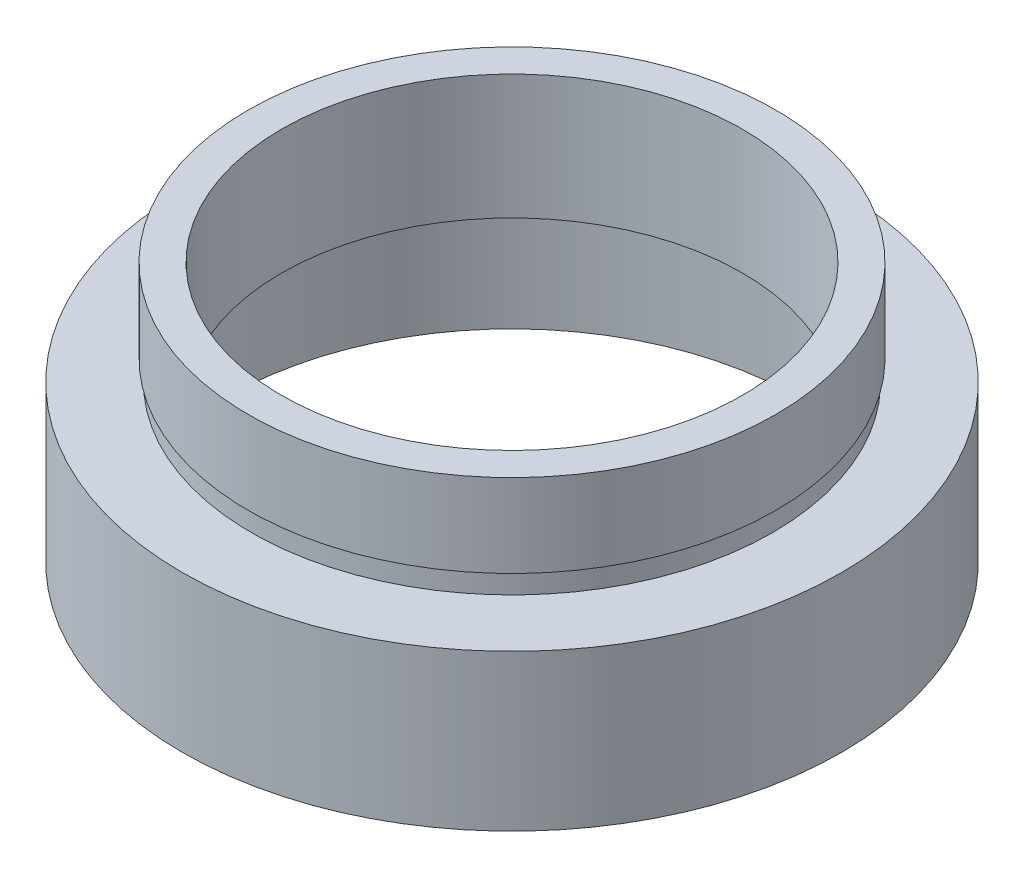
ISO-10303-21;
HEADER;
FILE_DESCRIPTION(('STEP AP214'),'2;1');
FILE_NAME('part.step','',(''),(''),'','','');
FILE_SCHEMA(('AUTOMOTIVE_DESIGN { 1 0 10303 214 1 1 1 1 }'));
ENDSEC;
DATA;
#1=APPLICATION_CONTEXT('core data for automotive mechanical design processes');
#2=APPLICATION_PROTOCOL_DEFINITION('international standard','automotive_design',2000,#1);
#3=PRODUCT_CONTEXT('',#1,'mechanical');
#4=PRODUCT('Part','Part','',(#3));
#5=PRODUCT_RELATED_PRODUCT_CATEGORY('part','',(#4));
#6=PRODUCT_DEFINITION_FORMATION('','',#4);
#7=PRODUCT_DEFINITION_CONTEXT('part definition',#1,'design');
#8=PRODUCT_DEFINITION('design','',#6,#7);
#9=PRODUCT_DEFINITION_SHAPE('','',#8);
#10=(LENGTH_UNIT() NAMED_UNIT(*) SI_UNIT(.MILLI.,.METRE.));
#11=(NAMED_UNIT(*) PLANE_ANGLE_UNIT() SI_UNIT($,.RADIAN.));
#12=(NAMED_UNIT(*) SI_UNIT($,.STERADIAN.) SOLID_ANGLE_UNIT());
#13=UNCERTAINTY_MEASURE_WITH_UNIT(LENGTH_MEASURE(1.E-05),#10,'distance_accuracy_value','');
#14=(GEOMETRIC_REPRESENTATION_CONTEXT(3) GLOBAL_UNCERTAINTY_ASSIGNED_CONTEXT((#13)) GLOBAL_UNIT_ASSIGNED_CONTEXT((#10,
#11,#12)) REPRESENTATION_CONTEXT('',''));
#15=CARTESIAN_POINT('',(0.,0.,0.));
#16=DIRECTION('',(0.,0.,1.));
#17=DIRECTION('',(1.,0.,0.));
#18=AXIS2_PLACEMENT_3D('',#15,#16,#17);
#19=CARTESIAN_POINT('',(15.875,0.,0.));
#20=DIRECTION('',(0.,1.,0.));
#21=DIRECTION('',(-1.,0.,0.));
#22=AXIS2_PLACEMENT_3D('',#19,#20,#21);
#23=PLANE('',#22);
#24=CARTESIAN_POINT('',(0.,0.,0.));
#25=DIRECTION('',(0.,1.,0.));
#26=DIRECTION('',(-1.,0.,0.));
#27=AXIS2_PLACEMENT_3D('',#24,#25,#26);
#28=CIRCLE('',#27,15.875);
#29=CARTESIAN_POINT('',(-15.875,0.,0.));
#30=VERTEX_POINT('',#29);
#31=EDGE_CURVE('E76',#30,#30,#28,.T.);
#32=ORIENTED_EDGE('',*,*,#31,.F.);
#33=EDGE_LOOP('',(#32));
#34=FACE_BOUND('',#33,.T.);
#35=CARTESIAN_POINT('',(0.,0.,0.));
#36=DIRECTION('',(0.,1.,0.));
#37=DIRECTION('',(-1.,0.,0.));
#38=AXIS2_PLACEMENT_3D('',#35,#36,#37);
#39=CIRCLE('',#38,13.75);
#40=CARTESIAN_POINT('',(-13.75,0.,0.));
#41=VERTEX_POINT('',#40);
#42=EDGE_CURVE('E10',#41,#41,#39,.T.);
#43=ORIENTED_EDGE('',*,*,#42,.T.);
#44=EDGE_LOOP('',(#43));
#45=FACE_BOUND('',#44,.T.);
#46=ADVANCED_FACE('F36',(#34,#45),#23,.F.);
#47=CARTESIAN_POINT('',(0.,16.8860182370821,0.));
#48=DIRECTION('',(0.,1.,0.));
#49=DIRECTION('',(-1.,0.,0.));
#50=AXIS2_PLACEMENT_3D('',#47,#48,#49);
#51=CYLINDRICAL_SURFACE('',#50,13.75);
#52=ORIENTED_EDGE('',*,*,#42,.F.);
#53=EDGE_LOOP('',(#52));
#54=FACE_BOUND('',#53,.T.);
#55=CARTESIAN_POINT('',(0.,5.5,0.));
#56=DIRECTION('',(0.,1.,0.));
#57=DIRECTION('',(-1.,0.,0.));
#58=AXIS2_PLACEMENT_3D('',#55,#56,#57);
#59=CIRCLE('',#58,13.75);
#60=CARTESIAN_POINT('',(-13.75,5.49999999999999,0.));
#61=VERTEX_POINT('',#60);
#62=EDGE_CURVE('E42',#61,#61,#59,.T.);
#63=ORIENTED_EDGE('',*,*,#62,.T.);
#64=EDGE_LOOP('',(#63));
#65=FACE_BOUND('',#64,.T.);
#66=ADVANCED_FACE('F83',(#54,#65),#51,.F.);
#67=CARTESIAN_POINT('',(13.75,5.5,0.));
#68=DIRECTION('',(0.,-1.,0.));
#69=DIRECTION('',(1.,0.,0.));
#70=AXIS2_PLACEMENT_3D('',#67,#68,#69);
#71=PLANE('',#70);
#72=ORIENTED_EDGE('',*,*,#62,.F.);
#73=EDGE_LOOP('',(#72));
#74=FACE_BOUND('',#73,.T.);
#75=CARTESIAN_POINT('',(0.,5.5,0.));
#76=DIRECTION('',(0.,1.,0.));
#77=DIRECTION('',(-1.,0.,0.));
#78=AXIS2_PLACEMENT_3D('',#75,#76,#77);
#79=CIRCLE('',#78,14.35);
#80=CARTESIAN_POINT('',(-14.35,5.49999999999999,0.));
#81=VERTEX_POINT('',#80);
#82=EDGE_CURVE('E46',#81,#81,#79,.T.);
#83=ORIENTED_EDGE('',*,*,#82,.T.);
#84=EDGE_LOOP('',(#83));
#85=FACE_BOUND('',#84,.T.);
#86=ADVANCED_FACE('F87',(#74,#85),#71,.F.);
#87=CARTESIAN_POINT('',(0.,16.8860182370821,0.));
#88=DIRECTION('',(0.,1.,0.));
#89=DIRECTION('',(-1.,0.,0.));
#90=AXIS2_PLACEMENT_3D('',#87,#88,#89);
#91=CYLINDRICAL_SURFACE('',#90,14.35);
#92=ORIENTED_EDGE('',*,*,#82,.F.);
#93=EDGE_LOOP('',(#92));
#94=FACE_BOUND('',#93,.T.);
#95=CARTESIAN_POINT('',(0.,6.5,0.));
#96=DIRECTION('',(0.,1.,0.));
#97=DIRECTION('',(-1.,0.,0.));
#98=AXIS2_PLACEMENT_3D('',#95,#96,#97);
#99=CIRCLE('',#98,14.35);
#100=CARTESIAN_POINT('',(-14.35,6.5,0.));
#101=VERTEX_POINT('',#100);
#102=EDGE_CURVE('E50',#101,#101,#99,.T.);
#103=ORIENTED_EDGE('',*,*,#102,.T.);
#104=EDGE_LOOP('',(#103));
#105=FACE_BOUND('',#104,.T.);
#106=ADVANCED_FACE('F92',(#94,#105),#91,.F.);
#107=CARTESIAN_POINT('',(11.1,6.5,0.));
#108=DIRECTION('',(0.,1.,0.));
#109=DIRECTION('',(-1.,0.,0.));
#110=AXIS2_PLACEMENT_3D('',#107,#108,#109);
#111=PLANE('',#110);
#112=ORIENTED_EDGE('',*,*,#102,.F.);
#113=EDGE_LOOP('',(#112));
#114=FACE_BOUND('',#113,.T.);
#115=CARTESIAN_POINT('',(0.,6.5,0.));
#116=DIRECTION('',(0.,1.,0.));
#117=DIRECTION('',(-1.,0.,0.));
#118=AXIS2_PLACEMENT_3D('',#115,#116,#117);
#119=CIRCLE('',#118,11.1);
#120=CARTESIAN_POINT('',(-11.1,6.5,0.));
#121=VERTEX_POINT('',#120);
#122=EDGE_CURVE('E55',#121,#121,#119,.T.);
#123=ORIENTED_EDGE('',*,*,#122,.T.);
#124=EDGE_LOOP('',(#123));
#125=FACE_BOUND('',#124,.T.);
#126=ADVANCED_FACE('F98',(#114,#125),#111,.F.);
#127=CARTESIAN_POINT('',(0.,16.8860182370821,0.));
#128=DIRECTION('',(0.,1.,0.));
#129=DIRECTION('',(-1.,0.,0.));
#130=AXIS2_PLACEMENT_3D('',#127,#128,#129);
#131=CYLINDRICAL_SURFACE('',#130,11.1);
#132=ORIENTED_EDGE('',*,*,#122,.F.);
#133=EDGE_LOOP('',(#132));
#134=FACE_BOUND('',#133,.T.);
#135=CARTESIAN_POINT('',(0.,12.5,0.));
#136=DIRECTION('',(0.,1.,0.));
#137=DIRECTION('',(-1.,0.,0.));
#138=AXIS2_PLACEMENT_3D('',#135,#136,#137);
#139=CIRCLE('',#138,11.1);
#140=CARTESIAN_POINT('',(-11.1,12.5,0.));
#141=VERTEX_POINT('',#140);
#142=EDGE_CURVE('E58',#141,#141,#139,.T.);
#143=ORIENTED_EDGE('',*,*,#142,.T.);
#144=EDGE_LOOP('',(#143));
#145=FACE_BOUND('',#144,.T.);
#146=ADVANCED_FACE('F102',(#134,#145),#131,.F.);
#147=CARTESIAN_POINT('',(11.1,12.5,0.));
#148=DIRECTION('',(0.,-1.,0.));
#149=DIRECTION('',(1.,0.,0.));
#150=AXIS2_PLACEMENT_3D('',#147,#148,#149);
#151=PLANE('',#150);
#152=ORIENTED_EDGE('',*,*,#142,.F.);
#153=EDGE_LOOP('',(#152));
#154=FACE_BOUND('',#153,.T.);
#155=CARTESIAN_POINT('',(0.,12.5,0.));
#156=DIRECTION('',(0.,1.,0.));
#157=DIRECTION('',(-1.,0.,0.));
#158=AXIS2_PLACEMENT_3D('',#155,#156,#157);
#159=CIRCLE('',#158,12.7);
#160=CARTESIAN_POINT('',(-12.7,12.5,0.));
#161=VERTEX_POINT('',#160);
#162=EDGE_CURVE('E61',#161,#161,#159,.T.);
#163=ORIENTED_EDGE('',*,*,#162,.T.);
#164=EDGE_LOOP('',(#163));
#165=FACE_BOUND('',#164,.T.);
#166=ADVANCED_FACE('F106',(#154,#165),#151,.F.);
#167=CARTESIAN_POINT('',(0.,16.8860182370821,0.));
#168=DIRECTION('',(0.,1.,0.));
#169=DIRECTION('',(-1.,0.,0.));
#170=AXIS2_PLACEMENT_3D('',#167,#168,#169);
#171=CYLINDRICAL_SURFACE('',#170,12.7);
#172=ORIENTED_EDGE('',*,*,#162,.F.);
#173=EDGE_LOOP('',(#172));
#174=FACE_BOUND('',#173,.T.);
#175=CARTESIAN_POINT('',(0.,8.5,0.));
#176=DIRECTION('',(0.,1.,0.));
#177=DIRECTION('',(-1.,0.,0.));
#178=AXIS2_PLACEMENT_3D('',#175,#176,#177);
#179=CIRCLE('',#178,12.7);
#180=CARTESIAN_POINT('',(-12.7,8.5,0.));
#181=VERTEX_POINT('',#180);
#182=EDGE_CURVE('E64',#181,#181,#179,.T.);
#183=ORIENTED_EDGE('',*,*,#182,.T.);
#184=EDGE_LOOP('',(#183));
#185=FACE_BOUND('',#184,.T.);
#186=ADVANCED_FACE('F110',(#174,#185),#171,.T.);
#187=CARTESIAN_POINT('',(12.7,8.5,0.));
#188=DIRECTION('',(0.,1.,0.));
#189=DIRECTION('',(-1.,0.,0.));
#190=AXIS2_PLACEMENT_3D('',#187,#188,#189);
#191=PLANE('',#190);
#192=ORIENTED_EDGE('',*,*,#182,.F.);
#193=EDGE_LOOP('',(#192));
#194=FACE_BOUND('',#193,.T.);
#195=CARTESIAN_POINT('',(0.,8.5,0.));
#196=DIRECTION('',(0.,1.,0.));
#197=DIRECTION('',(-1.,0.,0.));
#198=AXIS2_PLACEMENT_3D('',#195,#196,#197);
#199=CIRCLE('',#198,12.55);
#200=CARTESIAN_POINT('',(-12.55,8.5,0.));
#201=VERTEX_POINT('',#200);
#202=EDGE_CURVE('E67',#201,#201,#199,.T.);
#203=ORIENTED_EDGE('',*,*,#202,.T.);
#204=EDGE_LOOP('',(#203));
#205=FACE_BOUND('',#204,.T.);
#206=ADVANCED_FACE('F114',(#194,#205),#191,.F.);
#207=CARTESIAN_POINT('',(0.,16.8860182370821,0.));
#208=DIRECTION('',(0.,1.,0.));
#209=DIRECTION('',(-1.,0.,0.));
#210=AXIS2_PLACEMENT_3D('',#207,#208,#209);
#211=CYLINDRICAL_SURFACE('',#210,12.55);
#212=ORIENTED_EDGE('',*,*,#202,.F.);
#213=EDGE_LOOP('',(#212));
#214=FACE_BOUND('',#213,.T.);
#215=CARTESIAN_POINT('',(0.,7.5,0.));
#216=DIRECTION('',(0.,1.,0.));
#217=DIRECTION('',(-1.,0.,0.));
#218=AXIS2_PLACEMENT_3D('',#215,#216,#217);
#219=CIRCLE('',#218,12.55);
#220=CARTESIAN_POINT('',(-12.55,7.5,0.));
#221=VERTEX_POINT('',#220);
#222=EDGE_CURVE('E70',#221,#221,#219,.T.);
#223=ORIENTED_EDGE('',*,*,#222,.T.);
#224=EDGE_LOOP('',(#223));
#225=FACE_BOUND('',#224,.T.);
#226=ADVANCED_FACE('F118',(#214,#225),#211,.T.);
#227=CARTESIAN_POINT('',(12.55,7.5,0.));
#228=DIRECTION('',(0.,-1.,0.));
#229=DIRECTION('',(1.,0.,0.));
#230=AXIS2_PLACEMENT_3D('',#227,#228,#229);
#231=PLANE('',#230);
#232=ORIENTED_EDGE('',*,*,#222,.F.);
#233=EDGE_LOOP('',(#232));
#234=FACE_BOUND('',#233,.T.);
#235=CARTESIAN_POINT('',(0.,7.5,0.));
#236=DIRECTION('',(0.,1.,0.));
#237=DIRECTION('',(-1.,0.,0.));
#238=AXIS2_PLACEMENT_3D('',#235,#236,#237);
#239=CIRCLE('',#238,15.875);
#240=CARTESIAN_POINT('',(-15.875,7.5,0.));
#241=VERTEX_POINT('',#240);
#242=EDGE_CURVE('E73',#241,#241,#239,.T.);
#243=ORIENTED_EDGE('',*,*,#242,.T.);
#244=EDGE_LOOP('',(#243));
#245=FACE_BOUND('',#244,.T.);
#246=ADVANCED_FACE('F122',(#234,#245),#231,.F.);
#247=CARTESIAN_POINT('',(0.,16.8860182370821,0.));
#248=DIRECTION('',(0.,1.,0.));
#249=DIRECTION('',(-1.,0.,0.));
#250=AXIS2_PLACEMENT_3D('',#247,#248,#249);
#251=CYLINDRICAL_SURFACE('',#250,15.875);
#252=ORIENTED_EDGE('',*,*,#242,.F.);
#253=EDGE_LOOP('',(#252));
#254=FACE_BOUND('',#253,.T.);
#255=ORIENTED_EDGE('',*,*,#31,.T.);
#256=EDGE_LOOP('',(#255));
#257=FACE_BOUND('',#256,.T.);
#258=ADVANCED_FACE('F80',(#254,#257),#251,.T.);
#259=CLOSED_SHELL('',(#46,#66,#86,#106,#126,#146,#166,#186,#206,#226,#246,#258));
#260=MANIFOLD_SOLID_BREP('B2',#259);
#261=ADVANCED_BREP_SHAPE_REPRESENTATION('',(#18,#260),#14);
#262=SHAPE_DEFINITION_REPRESENTATION(#9,#261);
ENDSEC;
END-ISO-10303-21;
